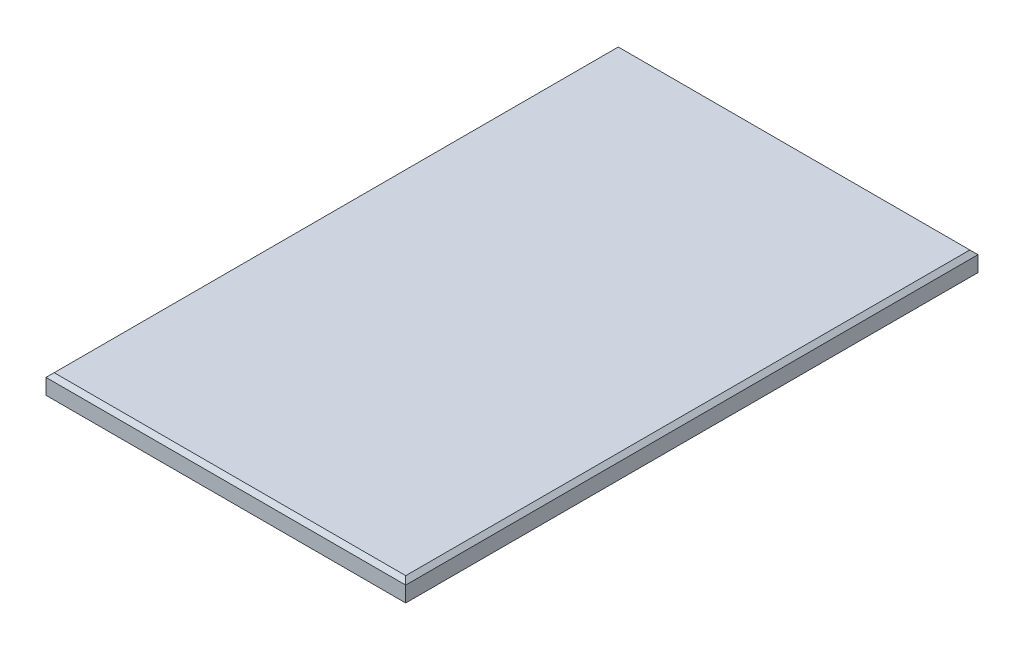
ISO-10303-21;
HEADER;
FILE_DESCRIPTION(('STEP AP214'),'2;1');
FILE_NAME('part.step','',(''),(''),'','','');
FILE_SCHEMA(('AUTOMOTIVE_DESIGN { 1 0 10303 214 1 1 1 1 }'));
ENDSEC;
DATA;
#1=APPLICATION_CONTEXT('core data for automotive mechanical design processes');
#2=APPLICATION_PROTOCOL_DEFINITION('international standard','automotive_design',2000,#1);
#3=PRODUCT_CONTEXT('',#1,'mechanical');
#4=PRODUCT('Part','Part','',(#3));
#5=PRODUCT_RELATED_PRODUCT_CATEGORY('part','',(#4));
#6=PRODUCT_DEFINITION_FORMATION('','',#4);
#7=PRODUCT_DEFINITION_CONTEXT('part definition',#1,'design');
#8=PRODUCT_DEFINITION('design','',#6,#7);
#9=PRODUCT_DEFINITION_SHAPE('','',#8);
#10=(LENGTH_UNIT() NAMED_UNIT(*) SI_UNIT(.MILLI.,.METRE.));
#11=(NAMED_UNIT(*) PLANE_ANGLE_UNIT() SI_UNIT($,.RADIAN.));
#12=(NAMED_UNIT(*) SI_UNIT($,.STERADIAN.) SOLID_ANGLE_UNIT());
#13=UNCERTAINTY_MEASURE_WITH_UNIT(LENGTH_MEASURE(1.E-05),#10,'distance_accuracy_value','');
#14=(GEOMETRIC_REPRESENTATION_CONTEXT(3) GLOBAL_UNCERTAINTY_ASSIGNED_CONTEXT((#13)) GLOBAL_UNIT_ASSIGNED_CONTEXT((#10,
#11,#12)) REPRESENTATION_CONTEXT('',''));
#15=CARTESIAN_POINT('',(0.,0.,0.));
#16=DIRECTION('',(0.,0.,1.));
#17=DIRECTION('',(1.,0.,0.));
#18=AXIS2_PLACEMENT_3D('',#15,#16,#17);
#19=CARTESIAN_POINT('',(0.,1.2,0.));
#20=DIRECTION('',(1.,0.,0.));
#21=DIRECTION('',(0.,0.,-1.));
#22=AXIS2_PLACEMENT_3D('',#19,#20,#21);
#23=PLANE('',#22);
#24=DIRECTION('',(0.,-1.,0.));
#25=VECTOR('',#24,1.);
#26=CARTESIAN_POINT('',(0.,1.2,0.));
#27=LINE('',#26,#25);
#28=CARTESIAN_POINT('',(0.,0.950000000000003,0.));
#29=VERTEX_POINT('',#28);
#30=CARTESIAN_POINT('',(0.,0.,0.));
#31=VERTEX_POINT('',#30);
#32=EDGE_CURVE('E95',#29,#31,#27,.T.);
#33=ORIENTED_EDGE('',*,*,#32,.F.);
#34=DIRECTION('',(0.,0.,-1.));
#35=VECTOR('',#34,1.);
#36=CARTESIAN_POINT('',(0.,0.950000000000003,0.));
#37=LINE('',#36,#35);
#38=CARTESIAN_POINT('',(0.,0.950000000000003,-35.));
#39=VERTEX_POINT('',#38);
#40=EDGE_CURVE('E52',#29,#39,#37,.T.);
#41=ORIENTED_EDGE('',*,*,#40,.T.);
#42=DIRECTION('',(0.,-1.,0.));
#43=VECTOR('',#42,1.);
#44=CARTESIAN_POINT('',(0.,1.2,-35.));
#45=LINE('',#44,#43);
#46=CARTESIAN_POINT('',(0.,0.,-35.));
#47=VERTEX_POINT('',#46);
#48=EDGE_CURVE('E114',#39,#47,#45,.T.);
#49=ORIENTED_EDGE('',*,*,#48,.T.);
#50=DIRECTION('',(0.,0.,1.));
#51=VECTOR('',#50,1.);
#52=CARTESIAN_POINT('',(0.,0.,0.));
#53=LINE('',#52,#51);
#54=EDGE_CURVE('E109',#47,#31,#53,.T.);
#55=ORIENTED_EDGE('',*,*,#54,.T.);
#56=EDGE_LOOP('',(#33,#41,#49,#55));
#57=FACE_BOUND('',#56,.T.);
#58=ADVANCED_FACE('F41',(#57),#23,.F.);
#59=CARTESIAN_POINT('',(0.,1.2,0.));
#60=DIRECTION('',(0.,0.,-1.));
#61=DIRECTION('',(-1.,0.,0.));
#62=AXIS2_PLACEMENT_3D('',#59,#60,#61);
#63=PLANE('',#62);
#64=DIRECTION('',(0.,-1.,0.));
#65=VECTOR('',#64,1.);
#66=CARTESIAN_POINT('',(22.,1.2,0.));
#67=LINE('',#66,#65);
#68=CARTESIAN_POINT('',(22.,0.950000000000003,0.));
#69=VERTEX_POINT('',#68);
#70=CARTESIAN_POINT('',(22.,0.,0.));
#71=VERTEX_POINT('',#70);
#72=EDGE_CURVE('E103',#69,#71,#67,.T.);
#73=ORIENTED_EDGE('',*,*,#72,.F.);
#74=DIRECTION('',(-1.,0.,0.));
#75=VECTOR('',#74,1.);
#76=CARTESIAN_POINT('',(0.,0.950000000000003,0.));
#77=LINE('',#76,#75);
#78=EDGE_CURVE('E67',#69,#29,#77,.T.);
#79=ORIENTED_EDGE('',*,*,#78,.T.);
#80=ORIENTED_EDGE('',*,*,#32,.T.);
#81=DIRECTION('',(1.,0.,0.));
#82=VECTOR('',#81,1.);
#83=CARTESIAN_POINT('',(0.,0.,0.));
#84=LINE('',#83,#82);
#85=EDGE_CURVE('E98',#31,#71,#84,.T.);
#86=ORIENTED_EDGE('',*,*,#85,.T.);
#87=EDGE_LOOP('',(#73,#79,#80,#86));
#88=FACE_BOUND('',#87,.T.);
#89=ADVANCED_FACE('F97',(#88),#63,.F.);
#90=CARTESIAN_POINT('',(22.,1.2,0.));
#91=DIRECTION('',(-1.,0.,0.));
#92=DIRECTION('',(0.,0.,1.));
#93=AXIS2_PLACEMENT_3D('',#90,#91,#92);
#94=PLANE('',#93);
#95=DIRECTION('',(0.,-1.,0.));
#96=VECTOR('',#95,1.);
#97=CARTESIAN_POINT('',(22.,1.2,-35.));
#98=LINE('',#97,#96);
#99=CARTESIAN_POINT('',(22.,0.950000000000003,-35.));
#100=VERTEX_POINT('',#99);
#101=CARTESIAN_POINT('',(22.,0.,-35.));
#102=VERTEX_POINT('',#101);
#103=EDGE_CURVE('E129',#100,#102,#98,.T.);
#104=ORIENTED_EDGE('',*,*,#103,.F.);
#105=DIRECTION('',(0.,0.,1.));
#106=VECTOR('',#105,1.);
#107=CARTESIAN_POINT('',(22.,0.950000000000003,0.));
#108=LINE('',#107,#106);
#109=EDGE_CURVE('E146',#100,#69,#108,.T.);
#110=ORIENTED_EDGE('',*,*,#109,.T.);
#111=ORIENTED_EDGE('',*,*,#72,.T.);
#112=DIRECTION('',(0.,0.,-1.));
#113=VECTOR('',#112,1.);
#114=CARTESIAN_POINT('',(22.,0.,0.));
#115=LINE('',#114,#113);
#116=EDGE_CURVE('E111',#71,#102,#115,.T.);
#117=ORIENTED_EDGE('',*,*,#116,.T.);
#118=EDGE_LOOP('',(#104,#110,#111,#117));
#119=FACE_BOUND('',#118,.T.);
#120=ADVANCED_FACE('F180',(#119),#94,.F.);
#121=CARTESIAN_POINT('',(0.,1.2,-35.));
#122=DIRECTION('',(0.,0.,1.));
#123=DIRECTION('',(1.,0.,0.));
#124=AXIS2_PLACEMENT_3D('',#121,#122,#123);
#125=PLANE('',#124);
#126=ORIENTED_EDGE('',*,*,#48,.F.);
#127=DIRECTION('',(1.,0.,0.));
#128=VECTOR('',#127,1.);
#129=CARTESIAN_POINT('',(0.,0.950000000000003,-35.));
#130=LINE('',#129,#128);
#131=EDGE_CURVE('E11',#39,#100,#130,.T.);
#132=ORIENTED_EDGE('',*,*,#131,.T.);
#133=ORIENTED_EDGE('',*,*,#103,.T.);
#134=DIRECTION('',(-1.,0.,0.));
#135=VECTOR('',#134,1.);
#136=CARTESIAN_POINT('',(0.,0.,-35.));
#137=LINE('',#136,#135);
#138=EDGE_CURVE('E124',#102,#47,#137,.T.);
#139=ORIENTED_EDGE('',*,*,#138,.T.);
#140=EDGE_LOOP('',(#126,#132,#133,#139));
#141=FACE_BOUND('',#140,.T.);
#142=ADVANCED_FACE('F182',(#141),#125,.F.);
#143=CARTESIAN_POINT('',(0.,1.2,0.));
#144=DIRECTION('',(0.,-1.,0.));
#145=DIRECTION('',(0.,0.,-1.));
#146=AXIS2_PLACEMENT_3D('',#143,#144,#145);
#147=PLANE('',#146);
#148=DIRECTION('',(1.,0.,0.));
#149=VECTOR('',#148,1.);
#150=CARTESIAN_POINT('',(0.,1.2,-0.25));
#151=LINE('',#150,#149);
#152=CARTESIAN_POINT('',(0.25,1.2,-0.25));
#153=VERTEX_POINT('',#152);
#154=CARTESIAN_POINT('',(21.75,1.2,-0.25));
#155=VERTEX_POINT('',#154);
#156=EDGE_CURVE('E139',#153,#155,#151,.T.);
#157=ORIENTED_EDGE('',*,*,#156,.T.);
#158=DIRECTION('',(0.,0.,-1.));
#159=VECTOR('',#158,1.);
#160=CARTESIAN_POINT('',(21.75,1.2,0.));
#161=LINE('',#160,#159);
#162=CARTESIAN_POINT('',(21.75,1.2,-34.75));
#163=VERTEX_POINT('',#162);
#164=EDGE_CURVE('E142',#155,#163,#161,.T.);
#165=ORIENTED_EDGE('',*,*,#164,.T.);
#166=DIRECTION('',(-1.,0.,0.));
#167=VECTOR('',#166,1.);
#168=CARTESIAN_POINT('',(0.,1.2,-34.75));
#169=LINE('',#168,#167);
#170=CARTESIAN_POINT('',(0.25,1.2,-34.75));
#171=VERTEX_POINT('',#170);
#172=EDGE_CURVE('E102',#163,#171,#169,.T.);
#173=ORIENTED_EDGE('',*,*,#172,.T.);
#174=DIRECTION('',(0.,0.,1.));
#175=VECTOR('',#174,1.);
#176=CARTESIAN_POINT('',(0.25,1.2,0.));
#177=LINE('',#176,#175);
#178=EDGE_CURVE('E136',#171,#153,#177,.T.);
#179=ORIENTED_EDGE('',*,*,#178,.T.);
#180=EDGE_LOOP('',(#157,#165,#173,#179));
#181=FACE_BOUND('',#180,.T.);
#182=ADVANCED_FACE('F172',(#181),#147,.F.);
#183=CARTESIAN_POINT('',(0.,0.,0.));
#184=DIRECTION('',(0.,-1.,0.));
#185=DIRECTION('',(0.,0.,-1.));
#186=AXIS2_PLACEMENT_3D('',#183,#184,#185);
#187=PLANE('',#186);
#188=ORIENTED_EDGE('',*,*,#54,.F.);
#189=ORIENTED_EDGE('',*,*,#138,.F.);
#190=ORIENTED_EDGE('',*,*,#116,.F.);
#191=ORIENTED_EDGE('',*,*,#85,.F.);
#192=EDGE_LOOP('',(#188,#189,#190,#191));
#193=FACE_BOUND('',#192,.T.);
#194=ADVANCED_FACE('F107',(#193),#187,.T.);
#195=CARTESIAN_POINT('',(0.25,1.2,0.));
#196=DIRECTION('',(0.707106781186543,-0.707106781186552,0.));
#197=DIRECTION('',(0.,0.,1.));
#198=AXIS2_PLACEMENT_3D('',#195,#196,#197);
#199=PLANE('',#198);
#200=DIRECTION('',(0.577350269189628,0.57735026918962,0.577350269189628));
#201=VECTOR('',#200,1.);
#202=CARTESIAN_POINT('',(0.166666666666666,1.11666666666667,-34.8333333333333));
#203=LINE('',#202,#201);
#204=EDGE_CURVE('E120',#39,#171,#203,.T.);
#205=ORIENTED_EDGE('',*,*,#204,.F.);
#206=ORIENTED_EDGE('',*,*,#40,.F.);
#207=DIRECTION('',(0.577350269189628,0.57735026918962,-0.577350269189628));
#208=VECTOR('',#207,1.);
#209=CARTESIAN_POINT('',(0.166666666666666,1.11666666666667,-0.166666666666666));
#210=LINE('',#209,#208);
#211=EDGE_CURVE('E46',#153,#29,#210,.F.);
#212=ORIENTED_EDGE('',*,*,#211,.F.);
#213=ORIENTED_EDGE('',*,*,#178,.F.);
#214=EDGE_LOOP('',(#205,#206,#212,#213));
#215=FACE_BOUND('',#214,.T.);
#216=ADVANCED_FACE('F44',(#215),#199,.F.);
#217=CARTESIAN_POINT('',(0.,1.2,-0.25));
#218=DIRECTION('',(0.,-0.707106781186552,-0.707106781186543));
#219=DIRECTION('',(1.,0.,0.));
#220=AXIS2_PLACEMENT_3D('',#217,#218,#219);
#221=PLANE('',#220);
#222=ORIENTED_EDGE('',*,*,#211,.T.);
#223=ORIENTED_EDGE('',*,*,#78,.F.);
#224=DIRECTION('',(-0.577350269189629,0.57735026918962,-0.577350269189628));
#225=VECTOR('',#224,1.);
#226=CARTESIAN_POINT('',(14.4999999999999,8.44999999999997,-7.50000000000007));
#227=LINE('',#226,#225);
#228=EDGE_CURVE('E157',#155,#69,#227,.F.);
#229=ORIENTED_EDGE('',*,*,#228,.F.);
#230=ORIENTED_EDGE('',*,*,#156,.F.);
#231=EDGE_LOOP('',(#222,#223,#229,#230));
#232=FACE_BOUND('',#231,.T.);
#233=ADVANCED_FACE('F209',(#232),#221,.F.);
#234=CARTESIAN_POINT('',(0.,1.2,-34.75));
#235=DIRECTION('',(0.,-0.707106781186552,0.707106781186543));
#236=DIRECTION('',(-1.,0.,0.));
#237=AXIS2_PLACEMENT_3D('',#234,#235,#236);
#238=PLANE('',#237);
#239=ORIENTED_EDGE('',*,*,#204,.T.);
#240=ORIENTED_EDGE('',*,*,#172,.F.);
#241=DIRECTION('',(0.577350269189628,-0.577350269189621,-0.577350269189629));
#242=VECTOR('',#241,1.);
#243=CARTESIAN_POINT('',(14.4999999999999,8.44999999999996,-27.4999999999999));
#244=LINE('',#243,#242);
#245=EDGE_CURVE('E154',#100,#163,#244,.F.);
#246=ORIENTED_EDGE('',*,*,#245,.F.);
#247=ORIENTED_EDGE('',*,*,#131,.F.);
#248=EDGE_LOOP('',(#239,#240,#246,#247));
#249=FACE_BOUND('',#248,.T.);
#250=ADVANCED_FACE('F165',(#249),#238,.F.);
#251=CARTESIAN_POINT('',(21.75,1.2,0.));
#252=DIRECTION('',(-0.707106781186543,-0.707106781186552,0.));
#253=DIRECTION('',(0.,0.,-1.));
#254=AXIS2_PLACEMENT_3D('',#251,#252,#253);
#255=PLANE('',#254);
#256=ORIENTED_EDGE('',*,*,#228,.T.);
#257=ORIENTED_EDGE('',*,*,#109,.F.);
#258=ORIENTED_EDGE('',*,*,#245,.T.);
#259=ORIENTED_EDGE('',*,*,#164,.F.);
#260=EDGE_LOOP('',(#256,#257,#258,#259));
#261=FACE_BOUND('',#260,.T.);
#262=ADVANCED_FACE('F176',(#261),#255,.F.);
#263=CLOSED_SHELL('',(#58,#89,#120,#142,#182,#194,#216,#233,#250,#262));
#264=MANIFOLD_SOLID_BREP('B2',#263);
#265=ADVANCED_BREP_SHAPE_REPRESENTATION('',(#18,#264),#14);
#266=SHAPE_DEFINITION_REPRESENTATION(#9,#265);
ENDSEC;
END-ISO-10303-21;
